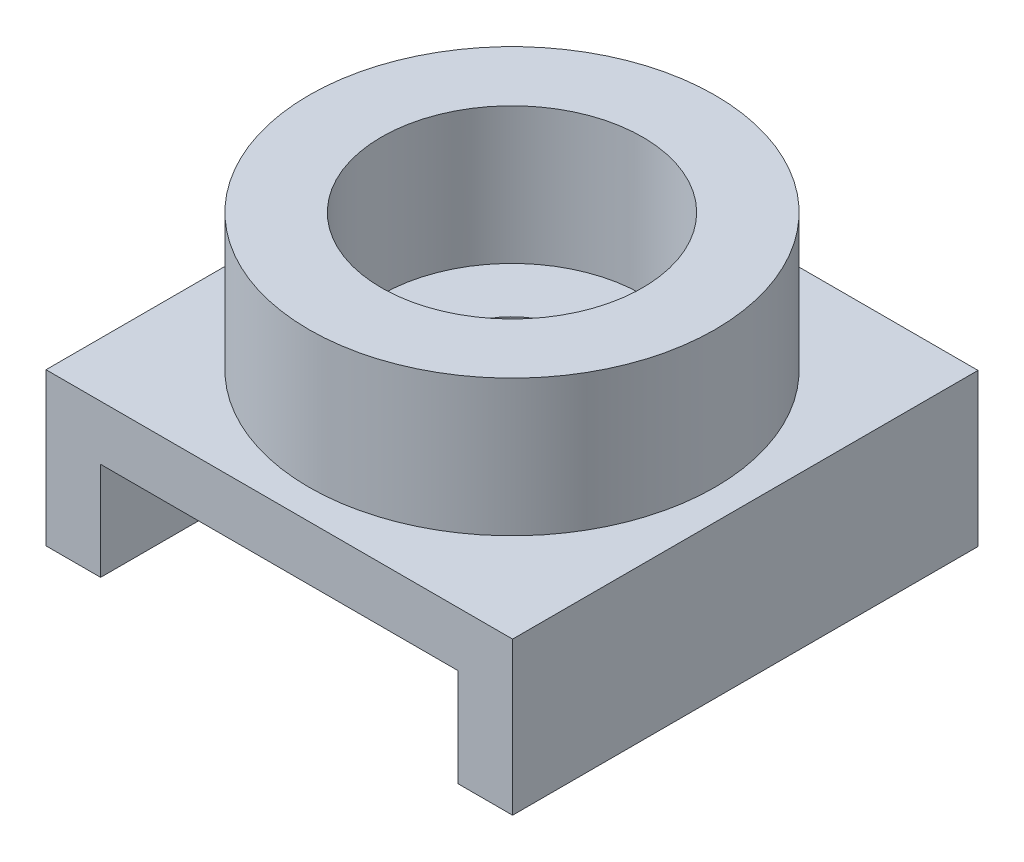
ISO-10303-21;
HEADER;
FILE_DESCRIPTION(('STEP AP214'),'2;1');
FILE_NAME('part.step','',(''),(''),'','','');
FILE_SCHEMA(('AUTOMOTIVE_DESIGN { 1 0 10303 214 1 1 1 1 }'));
ENDSEC;
DATA;
#1=APPLICATION_CONTEXT('core data for automotive mechanical design processes');
#2=APPLICATION_PROTOCOL_DEFINITION('international standard','automotive_design',2000,#1);
#3=PRODUCT_CONTEXT('',#1,'mechanical');
#4=PRODUCT('Part','Part','',(#3));
#5=PRODUCT_RELATED_PRODUCT_CATEGORY('part','',(#4));
#6=PRODUCT_DEFINITION_FORMATION('','',#4);
#7=PRODUCT_DEFINITION_CONTEXT('part definition',#1,'design');
#8=PRODUCT_DEFINITION('design','',#6,#7);
#9=PRODUCT_DEFINITION_SHAPE('','',#8);
#10=(LENGTH_UNIT() NAMED_UNIT(*) SI_UNIT(.MILLI.,.METRE.));
#11=(NAMED_UNIT(*) PLANE_ANGLE_UNIT() SI_UNIT($,.RADIAN.));
#12=(NAMED_UNIT(*) SI_UNIT($,.STERADIAN.) SOLID_ANGLE_UNIT());
#13=UNCERTAINTY_MEASURE_WITH_UNIT(LENGTH_MEASURE(1.E-05),#10,'distance_accuracy_value','');
#14=(GEOMETRIC_REPRESENTATION_CONTEXT(3) GLOBAL_UNCERTAINTY_ASSIGNED_CONTEXT((#13)) GLOBAL_UNIT_ASSIGNED_CONTEXT((#10,
#11,#12)) REPRESENTATION_CONTEXT('',''));
#15=CARTESIAN_POINT('',(0.,0.,0.));
#16=DIRECTION('',(0.,0.,1.));
#17=DIRECTION('',(1.,0.,0.));
#18=AXIS2_PLACEMENT_3D('',#15,#16,#17);
#19=CARTESIAN_POINT('',(-4.9911,3.2639,4.9784));
#20=DIRECTION('',(0.,-1.,0.));
#21=DIRECTION('',(0.,0.,-1.));
#22=AXIS2_PLACEMENT_3D('',#19,#20,#21);
#23=PLANE('',#22);
#24=DIRECTION('',(-1.,0.,0.));
#25=VECTOR('',#24,1.);
#26=CARTESIAN_POINT('',(-4.9911,3.2639,-4.9784));
#27=LINE('',#26,#25);
#28=CARTESIAN_POINT('',(4.9911,3.2639,-4.9784));
#29=VERTEX_POINT('',#28);
#30=CARTESIAN_POINT('',(-4.9911,3.2639,-4.9784));
#31=VERTEX_POINT('',#30);
#32=EDGE_CURVE('E123',#29,#31,#27,.T.);
#33=ORIENTED_EDGE('',*,*,#32,.T.);
#34=DIRECTION('',(0.,0.,-1.));
#35=VECTOR('',#34,1.);
#36=CARTESIAN_POINT('',(-4.9911,3.2639,4.9784));
#37=LINE('',#36,#35);
#38=CARTESIAN_POINT('',(-4.9911,3.2639,4.9784));
#39=VERTEX_POINT('',#38);
#40=EDGE_CURVE('E120',#39,#31,#37,.T.);
#41=ORIENTED_EDGE('',*,*,#40,.F.);
#42=DIRECTION('',(-1.,0.,0.));
#43=VECTOR('',#42,1.);
#44=CARTESIAN_POINT('',(-4.9911,3.2639,4.9784));
#45=LINE('',#44,#43);
#46=CARTESIAN_POINT('',(4.9911,3.2639,4.9784));
#47=VERTEX_POINT('',#46);
#48=EDGE_CURVE('E109',#47,#39,#45,.T.);
#49=ORIENTED_EDGE('',*,*,#48,.F.);
#50=DIRECTION('',(0.,0.,-1.));
#51=VECTOR('',#50,1.);
#52=CARTESIAN_POINT('',(4.9911,3.2639,4.9784));
#53=LINE('',#52,#51);
#54=EDGE_CURVE('E124',#47,#29,#53,.T.);
#55=ORIENTED_EDGE('',*,*,#54,.T.);
#56=EDGE_LOOP('',(#33,#41,#49,#55));
#57=FACE_BOUND('',#56,.T.);
#58=CARTESIAN_POINT('',(0.,3.2639,0.));
#59=DIRECTION('',(0.,-1.,0.));
#60=DIRECTION('',(0.,0.,-1.));
#61=AXIS2_PLACEMENT_3D('',#58,#59,#60);
#62=CIRCLE('',#61,4.3434);
#63=CARTESIAN_POINT('',(0.,3.2639,-4.3434));
#64=VERTEX_POINT('',#63);
#65=EDGE_CURVE('E12',#64,#64,#62,.F.);
#66=ORIENTED_EDGE('',*,*,#65,.F.);
#67=EDGE_LOOP('',(#66));
#68=FACE_BOUND('',#67,.T.);
#69=ADVANCED_FACE('F35',(#57,#68),#23,.F.);
#70=CARTESIAN_POINT('',(-3.8227,2.0955,4.9784));
#71=DIRECTION('',(-1.,0.,0.));
#72=DIRECTION('',(0.,-1.,0.));
#73=AXIS2_PLACEMENT_3D('',#70,#71,#72);
#74=PLANE('',#73);
#75=DIRECTION('',(0.,1.,0.));
#76=VECTOR('',#75,1.);
#77=CARTESIAN_POINT('',(-3.8227,2.0955,-4.9784));
#78=LINE('',#77,#76);
#79=CARTESIAN_POINT('',(-3.8227,0.,-4.9784));
#80=VERTEX_POINT('',#79);
#81=CARTESIAN_POINT('',(-3.8227,2.0955,-4.9784));
#82=VERTEX_POINT('',#81);
#83=EDGE_CURVE('E133',#80,#82,#78,.T.);
#84=ORIENTED_EDGE('',*,*,#83,.T.);
#85=DIRECTION('',(0.,0.,-1.));
#86=VECTOR('',#85,1.);
#87=CARTESIAN_POINT('',(-3.8227,2.0955,4.9784));
#88=LINE('',#87,#86);
#89=CARTESIAN_POINT('',(-3.8227,2.0955,4.9784));
#90=VERTEX_POINT('',#89);
#91=EDGE_CURVE('E44',#90,#82,#88,.T.);
#92=ORIENTED_EDGE('',*,*,#91,.F.);
#93=DIRECTION('',(0.,1.,0.));
#94=VECTOR('',#93,1.);
#95=CARTESIAN_POINT('',(-3.8227,2.0955,4.9784));
#96=LINE('',#95,#94);
#97=CARTESIAN_POINT('',(-3.8227,0.,4.9784));
#98=VERTEX_POINT('',#97);
#99=EDGE_CURVE('E148',#98,#90,#96,.T.);
#100=ORIENTED_EDGE('',*,*,#99,.F.);
#101=DIRECTION('',(0.,0.,-1.));
#102=VECTOR('',#101,1.);
#103=CARTESIAN_POINT('',(-3.8227,0.,4.9784));
#104=LINE('',#103,#102);
#105=EDGE_CURVE('E129',#98,#80,#104,.T.);
#106=ORIENTED_EDGE('',*,*,#105,.T.);
#107=EDGE_LOOP('',(#84,#92,#100,#106));
#108=FACE_BOUND('',#107,.T.);
#109=ADVANCED_FACE('F37',(#108),#74,.F.);
#110=CARTESIAN_POINT('',(3.8227,2.0955,4.9784));
#111=DIRECTION('',(0.,1.,0.));
#112=DIRECTION('',(0.,0.,1.));
#113=AXIS2_PLACEMENT_3D('',#110,#111,#112);
#114=PLANE('',#113);
#115=CARTESIAN_POINT('',(0.,2.0955,0.));
#116=DIRECTION('',(0.,1.,0.));
#117=DIRECTION('',(0.,0.,1.));
#118=AXIS2_PLACEMENT_3D('',#115,#116,#117);
#119=CIRCLE('',#118,1.397);
#120=CARTESIAN_POINT('',(0.,2.0955,1.397));
#121=VERTEX_POINT('',#120);
#122=EDGE_CURVE('E189',#121,#121,#119,.F.);
#123=ORIENTED_EDGE('',*,*,#122,.F.);
#124=EDGE_LOOP('',(#123));
#125=FACE_BOUND('',#124,.T.);
#126=DIRECTION('',(1.,0.,0.));
#127=VECTOR('',#126,1.);
#128=CARTESIAN_POINT('',(3.8227,2.0955,-4.9784));
#129=LINE('',#128,#127);
#130=CARTESIAN_POINT('',(3.8227,2.0955,-4.9784));
#131=VERTEX_POINT('',#130);
#132=EDGE_CURVE('E136',#82,#131,#129,.T.);
#133=ORIENTED_EDGE('',*,*,#132,.T.);
#134=DIRECTION('',(0.,0.,-1.));
#135=VECTOR('',#134,1.);
#136=CARTESIAN_POINT('',(3.8227,2.0955,4.9784));
#137=LINE('',#136,#135);
#138=CARTESIAN_POINT('',(3.8227,2.0955,4.9784));
#139=VERTEX_POINT('',#138);
#140=EDGE_CURVE('E158',#139,#131,#137,.T.);
#141=ORIENTED_EDGE('',*,*,#140,.F.);
#142=DIRECTION('',(1.,0.,0.));
#143=VECTOR('',#142,1.);
#144=CARTESIAN_POINT('',(3.8227,2.0955,4.9784));
#145=LINE('',#144,#143);
#146=EDGE_CURVE('E96',#90,#139,#145,.T.);
#147=ORIENTED_EDGE('',*,*,#146,.F.);
#148=ORIENTED_EDGE('',*,*,#91,.T.);
#149=EDGE_LOOP('',(#133,#141,#147,#148));
#150=FACE_BOUND('',#149,.T.);
#151=ADVANCED_FACE('F161',(#125,#150),#114,.F.);
#152=CARTESIAN_POINT('',(3.8227,2.0955,4.9784));
#153=DIRECTION('',(1.,0.,0.));
#154=DIRECTION('',(0.,1.,0.));
#155=AXIS2_PLACEMENT_3D('',#152,#153,#154);
#156=PLANE('',#155);
#157=DIRECTION('',(0.,-1.,0.));
#158=VECTOR('',#157,1.);
#159=CARTESIAN_POINT('',(3.8227,2.0955,-4.9784));
#160=LINE('',#159,#158);
#161=CARTESIAN_POINT('',(3.8227,0.,-4.9784));
#162=VERTEX_POINT('',#161);
#163=EDGE_CURVE('E139',#131,#162,#160,.T.);
#164=ORIENTED_EDGE('',*,*,#163,.T.);
#165=DIRECTION('',(0.,0.,-1.));
#166=VECTOR('',#165,1.);
#167=CARTESIAN_POINT('',(3.8227,0.,4.9784));
#168=LINE('',#167,#166);
#169=CARTESIAN_POINT('',(3.8227,0.,4.9784));
#170=VERTEX_POINT('',#169);
#171=EDGE_CURVE('E155',#170,#162,#168,.T.);
#172=ORIENTED_EDGE('',*,*,#171,.F.);
#173=DIRECTION('',(0.,-1.,0.));
#174=VECTOR('',#173,1.);
#175=CARTESIAN_POINT('',(3.8227,2.0955,4.9784));
#176=LINE('',#175,#174);
#177=EDGE_CURVE('E179',#139,#170,#176,.T.);
#178=ORIENTED_EDGE('',*,*,#177,.F.);
#179=ORIENTED_EDGE('',*,*,#140,.T.);
#180=EDGE_LOOP('',(#164,#172,#178,#179));
#181=FACE_BOUND('',#180,.T.);
#182=ADVANCED_FACE('F172',(#181),#156,.F.);
#183=CARTESIAN_POINT('',(3.8227,0.,4.9784));
#184=DIRECTION('',(0.,1.,0.));
#185=DIRECTION('',(-1.,0.,0.));
#186=AXIS2_PLACEMENT_3D('',#183,#184,#185);
#187=PLANE('',#186);
#188=DIRECTION('',(1.,0.,0.));
#189=VECTOR('',#188,1.);
#190=CARTESIAN_POINT('',(3.8227,0.,-4.9784));
#191=LINE('',#190,#189);
#192=CARTESIAN_POINT('',(4.9911,0.,-4.9784));
#193=VERTEX_POINT('',#192);
#194=EDGE_CURVE('E141',#162,#193,#191,.T.);
#195=ORIENTED_EDGE('',*,*,#194,.T.);
#196=DIRECTION('',(0.,0.,-1.));
#197=VECTOR('',#196,1.);
#198=CARTESIAN_POINT('',(4.9911,0.,4.9784));
#199=LINE('',#198,#197);
#200=CARTESIAN_POINT('',(4.9911,0.,4.9784));
#201=VERTEX_POINT('',#200);
#202=EDGE_CURVE('E152',#201,#193,#199,.T.);
#203=ORIENTED_EDGE('',*,*,#202,.F.);
#204=DIRECTION('',(1.,0.,0.));
#205=VECTOR('',#204,1.);
#206=CARTESIAN_POINT('',(3.8227,0.,4.9784));
#207=LINE('',#206,#205);
#208=EDGE_CURVE('E178',#170,#201,#207,.T.);
#209=ORIENTED_EDGE('',*,*,#208,.F.);
#210=ORIENTED_EDGE('',*,*,#171,.T.);
#211=EDGE_LOOP('',(#195,#203,#209,#210));
#212=FACE_BOUND('',#211,.T.);
#213=ADVANCED_FACE('F176',(#212),#187,.F.);
#214=CARTESIAN_POINT('',(4.9911,0.,4.9784));
#215=DIRECTION('',(-1.,0.,0.));
#216=DIRECTION('',(0.,0.,1.));
#217=AXIS2_PLACEMENT_3D('',#214,#215,#216);
#218=PLANE('',#217);
#219=DIRECTION('',(0.,1.,0.));
#220=VECTOR('',#219,1.);
#221=CARTESIAN_POINT('',(4.9911,0.,-4.9784));
#222=LINE('',#221,#220);
#223=EDGE_CURVE('E143',#193,#29,#222,.T.);
#224=ORIENTED_EDGE('',*,*,#223,.T.);
#225=ORIENTED_EDGE('',*,*,#54,.F.);
#226=DIRECTION('',(0.,1.,0.));
#227=VECTOR('',#226,1.);
#228=CARTESIAN_POINT('',(4.9911,0.,4.9784));
#229=LINE('',#228,#227);
#230=EDGE_CURVE('E115',#201,#47,#229,.T.);
#231=ORIENTED_EDGE('',*,*,#230,.F.);
#232=ORIENTED_EDGE('',*,*,#202,.T.);
#233=EDGE_LOOP('',(#224,#225,#231,#232));
#234=FACE_BOUND('',#233,.T.);
#235=ADVANCED_FACE('F237',(#234),#218,.F.);
#236=CARTESIAN_POINT('',(-4.9911,0.,4.9784));
#237=DIRECTION('',(1.,0.,0.));
#238=DIRECTION('',(0.,0.,-1.));
#239=AXIS2_PLACEMENT_3D('',#236,#237,#238);
#240=PLANE('',#239);
#241=DIRECTION('',(0.,-1.,0.));
#242=VECTOR('',#241,1.);
#243=CARTESIAN_POINT('',(-4.9911,0.,-4.9784));
#244=LINE('',#243,#242);
#245=CARTESIAN_POINT('',(-4.9911,0.,-4.9784));
#246=VERTEX_POINT('',#245);
#247=EDGE_CURVE('E81',#31,#246,#244,.T.);
#248=ORIENTED_EDGE('',*,*,#247,.T.);
#249=DIRECTION('',(0.,0.,-1.));
#250=VECTOR('',#249,1.);
#251=CARTESIAN_POINT('',(-4.9911,0.,4.9784));
#252=LINE('',#251,#250);
#253=CARTESIAN_POINT('',(-4.9911,0.,4.9784));
#254=VERTEX_POINT('',#253);
#255=EDGE_CURVE('E125',#254,#246,#252,.T.);
#256=ORIENTED_EDGE('',*,*,#255,.F.);
#257=DIRECTION('',(0.,-1.,0.));
#258=VECTOR('',#257,1.);
#259=CARTESIAN_POINT('',(-4.9911,0.,4.9784));
#260=LINE('',#259,#258);
#261=EDGE_CURVE('E113',#39,#254,#260,.T.);
#262=ORIENTED_EDGE('',*,*,#261,.F.);
#263=ORIENTED_EDGE('',*,*,#40,.T.);
#264=EDGE_LOOP('',(#248,#256,#262,#263));
#265=FACE_BOUND('',#264,.T.);
#266=ADVANCED_FACE('F127',(#265),#240,.F.);
#267=CARTESIAN_POINT('',(-3.8227,0.,4.9784));
#268=DIRECTION('',(0.,1.,0.));
#269=DIRECTION('',(-1.,0.,0.));
#270=AXIS2_PLACEMENT_3D('',#267,#268,#269);
#271=PLANE('',#270);
#272=DIRECTION('',(1.,0.,0.));
#273=VECTOR('',#272,1.);
#274=CARTESIAN_POINT('',(-3.8227,0.,-4.9784));
#275=LINE('',#274,#273);
#276=EDGE_CURVE('E87',#246,#80,#275,.T.);
#277=ORIENTED_EDGE('',*,*,#276,.T.);
#278=ORIENTED_EDGE('',*,*,#105,.F.);
#279=DIRECTION('',(1.,0.,0.));
#280=VECTOR('',#279,1.);
#281=CARTESIAN_POINT('',(-3.8227,0.,4.9784));
#282=LINE('',#281,#280);
#283=EDGE_CURVE('E52',#254,#98,#282,.T.);
#284=ORIENTED_EDGE('',*,*,#283,.F.);
#285=ORIENTED_EDGE('',*,*,#255,.T.);
#286=EDGE_LOOP('',(#277,#278,#284,#285));
#287=FACE_BOUND('',#286,.T.);
#288=ADVANCED_FACE('F288',(#287),#271,.F.);
#289=CARTESIAN_POINT('',(0.,0.,4.9784));
#290=DIRECTION('',(0.,0.,-1.));
#291=DIRECTION('',(-1.,0.,0.));
#292=AXIS2_PLACEMENT_3D('',#289,#290,#291);
#293=PLANE('',#292);
#294=ORIENTED_EDGE('',*,*,#99,.T.);
#295=ORIENTED_EDGE('',*,*,#146,.T.);
#296=ORIENTED_EDGE('',*,*,#177,.T.);
#297=ORIENTED_EDGE('',*,*,#208,.T.);
#298=ORIENTED_EDGE('',*,*,#230,.T.);
#299=ORIENTED_EDGE('',*,*,#48,.T.);
#300=ORIENTED_EDGE('',*,*,#261,.T.);
#301=ORIENTED_EDGE('',*,*,#283,.T.);
#302=EDGE_LOOP('',(#294,#295,#296,#297,#298,#299,#300,#301));
#303=FACE_BOUND('',#302,.T.);
#304=ADVANCED_FACE('F111',(#303),#293,.F.);
#305=CARTESIAN_POINT('',(0.,0.,-4.9784));
#306=DIRECTION('',(0.,0.,-1.));
#307=DIRECTION('',(-1.,0.,0.));
#308=AXIS2_PLACEMENT_3D('',#305,#306,#307);
#309=PLANE('',#308);
#310=ORIENTED_EDGE('',*,*,#83,.F.);
#311=ORIENTED_EDGE('',*,*,#276,.F.);
#312=ORIENTED_EDGE('',*,*,#247,.F.);
#313=ORIENTED_EDGE('',*,*,#32,.F.);
#314=ORIENTED_EDGE('',*,*,#223,.F.);
#315=ORIENTED_EDGE('',*,*,#194,.F.);
#316=ORIENTED_EDGE('',*,*,#163,.F.);
#317=ORIENTED_EDGE('',*,*,#132,.F.);
#318=EDGE_LOOP('',(#310,#311,#312,#313,#314,#315,#316,#317));
#319=FACE_BOUND('',#318,.T.);
#320=ADVANCED_FACE('F166',(#319),#309,.T.);
#321=CARTESIAN_POINT('',(0.,24.6547903736226,0.));
#322=DIRECTION('',(0.,-1.,0.));
#323=DIRECTION('',(0.,0.,-1.));
#324=AXIS2_PLACEMENT_3D('',#321,#322,#323);
#325=CYLINDRICAL_SURFACE('',#324,4.3434);
#326=ORIENTED_EDGE('',*,*,#65,.T.);
#327=EDGE_LOOP('',(#326));
#328=FACE_BOUND('',#327,.T.);
#329=CARTESIAN_POINT('',(0.,6.1849,0.));
#330=DIRECTION('',(0.,1.,0.));
#331=DIRECTION('',(-1.,0.,0.));
#332=AXIS2_PLACEMENT_3D('',#329,#330,#331);
#333=CIRCLE('',#332,4.3434);
#334=CARTESIAN_POINT('',(-4.3434,6.1849,0.));
#335=VERTEX_POINT('',#334);
#336=EDGE_CURVE('E137',#335,#335,#333,.T.);
#337=ORIENTED_EDGE('',*,*,#336,.F.);
#338=EDGE_LOOP('',(#337));
#339=FACE_BOUND('',#338,.T.);
#340=ADVANCED_FACE('F213',(#328,#339),#325,.T.);
#341=CARTESIAN_POINT('',(0.,24.6547903736226,0.));
#342=DIRECTION('',(0.,-1.,0.));
#343=DIRECTION('',(0.,0.,-1.));
#344=AXIS2_PLACEMENT_3D('',#341,#342,#343);
#345=CYLINDRICAL_SURFACE('',#344,2.794);
#346=CARTESIAN_POINT('',(0.,3.2639,0.));
#347=DIRECTION('',(0.,1.,0.));
#348=DIRECTION('',(0.,0.,1.));
#349=AXIS2_PLACEMENT_3D('',#346,#347,#348);
#350=CIRCLE('',#349,2.794);
#351=CARTESIAN_POINT('',(0.,3.2639,2.794));
#352=VERTEX_POINT('',#351);
#353=EDGE_CURVE('E188',#352,#352,#350,.T.);
#354=ORIENTED_EDGE('',*,*,#353,.F.);
#355=EDGE_LOOP('',(#354));
#356=FACE_BOUND('',#355,.T.);
#357=CARTESIAN_POINT('',(0.,6.1849,0.));
#358=DIRECTION('',(0.,1.,0.));
#359=DIRECTION('',(-1.,0.,0.));
#360=AXIS2_PLACEMENT_3D('',#357,#358,#359);
#361=CIRCLE('',#360,2.794);
#362=CARTESIAN_POINT('',(-2.794,6.1849,0.));
#363=VERTEX_POINT('',#362);
#364=EDGE_CURVE('E185',#363,#363,#361,.T.);
#365=ORIENTED_EDGE('',*,*,#364,.T.);
#366=EDGE_LOOP('',(#365));
#367=FACE_BOUND('',#366,.T.);
#368=ADVANCED_FACE('F210',(#356,#367),#345,.F.);
#369=CARTESIAN_POINT('',(-3.8227,6.1849,4.9784));
#370=DIRECTION('',(0.,1.,0.));
#371=DIRECTION('',(-1.,0.,0.));
#372=AXIS2_PLACEMENT_3D('',#369,#370,#371);
#373=PLANE('',#372);
#374=ORIENTED_EDGE('',*,*,#364,.F.);
#375=EDGE_LOOP('',(#374));
#376=FACE_BOUND('',#375,.T.);
#377=ORIENTED_EDGE('',*,*,#336,.T.);
#378=EDGE_LOOP('',(#377));
#379=FACE_BOUND('',#378,.T.);
#380=ADVANCED_FACE('F206',(#376,#379),#373,.T.);
#381=CARTESIAN_POINT('',(0.,3.2639,0.));
#382=DIRECTION('',(0.,1.,0.));
#383=DIRECTION('',(0.,0.,1.));
#384=AXIS2_PLACEMENT_3D('',#381,#382,#383);
#385=CIRCLE('',#384,1.397);
#386=CARTESIAN_POINT('',(0.,3.2639,1.397));
#387=VERTEX_POINT('',#386);
#388=EDGE_CURVE('E196',#387,#387,#385,.T.);
#389=ORIENTED_EDGE('',*,*,#388,.F.);
#390=EDGE_LOOP('',(#389));
#391=FACE_BOUND('',#390,.T.);
#392=ORIENTED_EDGE('',*,*,#353,.T.);
#393=EDGE_LOOP('',(#392));
#394=FACE_BOUND('',#393,.T.);
#395=ADVANCED_FACE('F203',(#391,#394),#23,.F.);
#396=CARTESIAN_POINT('',(0.,-0.000999999999997964,0.));
#397=DIRECTION('',(0.,1.,0.));
#398=DIRECTION('',(0.,0.,1.));
#399=AXIS2_PLACEMENT_3D('',#396,#397,#398);
#400=CYLINDRICAL_SURFACE('',#399,1.397);
#401=ORIENTED_EDGE('',*,*,#388,.T.);
#402=EDGE_LOOP('',(#401));
#403=FACE_BOUND('',#402,.T.);
#404=ORIENTED_EDGE('',*,*,#122,.T.);
#405=EDGE_LOOP('',(#404));
#406=FACE_BOUND('',#405,.T.);
#407=ADVANCED_FACE('F200',(#403,#406),#400,.F.);
#408=CLOSED_SHELL('',(#69,#109,#151,#182,#213,#235,#266,#288,#304,#320,#340,#368,#380,#395,#407));
#409=MANIFOLD_SOLID_BREP('B2',#408);
#410=ADVANCED_BREP_SHAPE_REPRESENTATION('',(#18,#409),#14);
#411=SHAPE_DEFINITION_REPRESENTATION(#9,#410);
ENDSEC;
END-ISO-10303-21;
